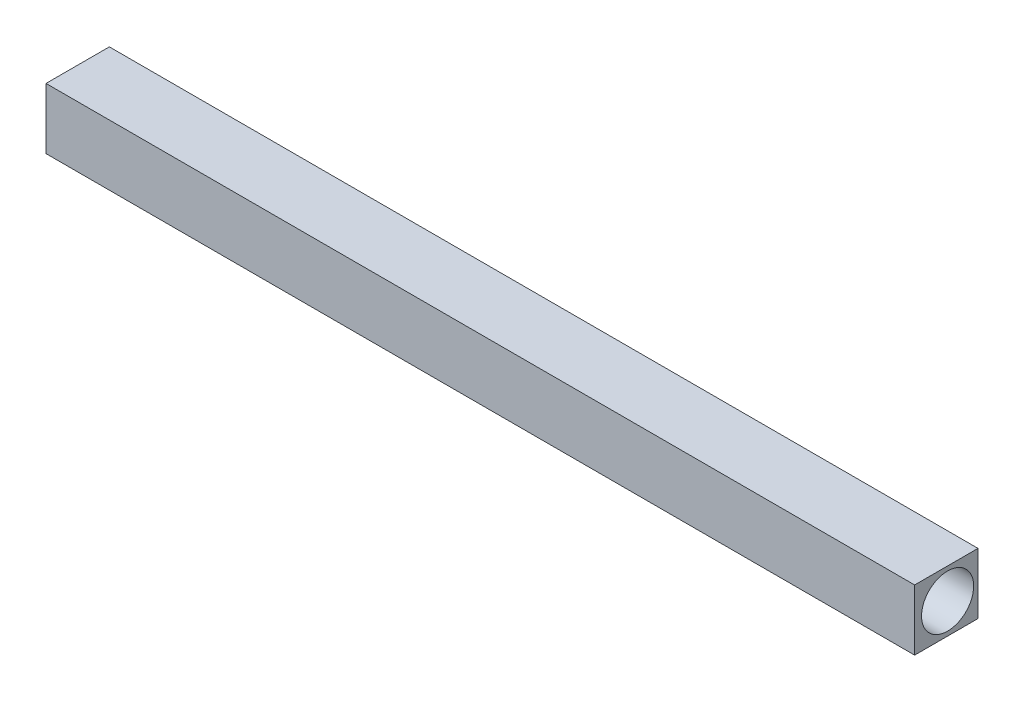
ISO-10303-21;
HEADER;
FILE_DESCRIPTION(('STEP AP214'),'2;1');
FILE_NAME('part.step','',(''),(''),'','','');
FILE_SCHEMA(('AUTOMOTIVE_DESIGN { 1 0 10303 214 1 1 1 1 }'));
ENDSEC;
DATA;
#1=APPLICATION_CONTEXT('core data for automotive mechanical design processes');
#2=APPLICATION_PROTOCOL_DEFINITION('international standard','automotive_design',2000,#1);
#3=PRODUCT_CONTEXT('',#1,'mechanical');
#4=PRODUCT('Part','Part','',(#3));
#5=PRODUCT_RELATED_PRODUCT_CATEGORY('part','',(#4));
#6=PRODUCT_DEFINITION_FORMATION('','',#4);
#7=PRODUCT_DEFINITION_CONTEXT('part definition',#1,'design');
#8=PRODUCT_DEFINITION('design','',#6,#7);
#9=PRODUCT_DEFINITION_SHAPE('','',#8);
#10=(LENGTH_UNIT() NAMED_UNIT(*) SI_UNIT(.MILLI.,.METRE.));
#11=(NAMED_UNIT(*) PLANE_ANGLE_UNIT() SI_UNIT($,.RADIAN.));
#12=(NAMED_UNIT(*) SI_UNIT($,.STERADIAN.) SOLID_ANGLE_UNIT());
#13=UNCERTAINTY_MEASURE_WITH_UNIT(LENGTH_MEASURE(1.E-05),#10,'distance_accuracy_value','');
#14=(GEOMETRIC_REPRESENTATION_CONTEXT(3) GLOBAL_UNCERTAINTY_ASSIGNED_CONTEXT((#13)) GLOBAL_UNIT_ASSIGNED_CONTEXT((#10,
#11,#12)) REPRESENTATION_CONTEXT('',''));
#15=CARTESIAN_POINT('',(0.,0.,0.));
#16=DIRECTION('',(0.,0.,1.));
#17=DIRECTION('',(1.,0.,0.));
#18=AXIS2_PLACEMENT_3D('',#15,#16,#17);
#19=CARTESIAN_POINT('',(-59.3425127184251,35.,0.));
#20=DIRECTION('',(1.,0.,0.));
#21=DIRECTION('',(0.,0.,-1.));
#22=AXIS2_PLACEMENT_3D('',#19,#20,#21);
#23=PLANE('',#22);
#24=CARTESIAN_POINT('',(-59.3425127184251,17.5,17.5));
#25=DIRECTION('',(1.,0.,0.));
#26=DIRECTION('',(0.,0.,-1.));
#27=AXIS2_PLACEMENT_3D('',#24,#25,#26);
#28=CIRCLE('',#27,15.);
#29=CARTESIAN_POINT('',(-59.3425127184251,17.5,2.5));
#30=VERTEX_POINT('',#29);
#31=EDGE_CURVE('E99',#30,#30,#28,.T.);
#32=ORIENTED_EDGE('',*,*,#31,.T.);
#33=EDGE_LOOP('',(#32));
#34=FACE_BOUND('',#33,.T.);
#35=DIRECTION('',(0.,0.,1.));
#36=VECTOR('',#35,1.);
#37=CARTESIAN_POINT('',(-59.3425127184251,0.,0.));
#38=LINE('',#37,#36);
#39=CARTESIAN_POINT('',(-59.3425127184251,0.,0.));
#40=VERTEX_POINT('',#39);
#41=CARTESIAN_POINT('',(-59.3425127184251,0.,36.4583333333333));
#42=VERTEX_POINT('',#41);
#43=EDGE_CURVE('E96',#40,#42,#38,.T.);
#44=ORIENTED_EDGE('',*,*,#43,.T.);
#45=DIRECTION('',(0.,-1.,0.));
#46=VECTOR('',#45,1.);
#47=CARTESIAN_POINT('',(-59.3425127184251,35.,36.4583333333333));
#48=LINE('',#47,#46);
#49=CARTESIAN_POINT('',(-59.3425127184251,35.,36.4583333333333));
#50=VERTEX_POINT('',#49);
#51=EDGE_CURVE('E11',#50,#42,#48,.T.);
#52=ORIENTED_EDGE('',*,*,#51,.F.);
#53=DIRECTION('',(0.,0.,1.));
#54=VECTOR('',#53,1.);
#55=CARTESIAN_POINT('',(-59.3425127184251,35.,0.));
#56=LINE('',#55,#54);
#57=CARTESIAN_POINT('',(-59.3425127184251,35.,0.));
#58=VERTEX_POINT('',#57);
#59=EDGE_CURVE('E84',#58,#50,#56,.T.);
#60=ORIENTED_EDGE('',*,*,#59,.F.);
#61=DIRECTION('',(0.,-1.,0.));
#62=VECTOR('',#61,1.);
#63=CARTESIAN_POINT('',(-59.3425127184251,35.,0.));
#64=LINE('',#63,#62);
#65=EDGE_CURVE('E92',#58,#40,#64,.T.);
#66=ORIENTED_EDGE('',*,*,#65,.T.);
#67=EDGE_LOOP('',(#44,#52,#60,#66));
#68=FACE_BOUND('',#67,.T.);
#69=ADVANCED_FACE('F33',(#34,#68),#23,.F.);
#70=CARTESIAN_POINT('',(-59.3425127184251,35.,36.4583333333333));
#71=DIRECTION('',(0.,0.,-1.));
#72=DIRECTION('',(-1.,0.,0.));
#73=AXIS2_PLACEMENT_3D('',#70,#71,#72);
#74=PLANE('',#73);
#75=DIRECTION('',(1.,0.,0.));
#76=VECTOR('',#75,1.);
#77=CARTESIAN_POINT('',(-59.3425127184251,0.,36.4583333333333));
#78=LINE('',#77,#76);
#79=CARTESIAN_POINT('',(440.657487281575,0.,36.4583333333333));
#80=VERTEX_POINT('',#79);
#81=EDGE_CURVE('E88',#42,#80,#78,.T.);
#82=ORIENTED_EDGE('',*,*,#81,.T.);
#83=DIRECTION('',(0.,-1.,0.));
#84=VECTOR('',#83,1.);
#85=CARTESIAN_POINT('',(440.657487281575,35.,36.4583333333333));
#86=LINE('',#85,#84);
#87=CARTESIAN_POINT('',(440.657487281575,35.,36.4583333333333));
#88=VERTEX_POINT('',#87);
#89=EDGE_CURVE('E41',#88,#80,#86,.T.);
#90=ORIENTED_EDGE('',*,*,#89,.F.);
#91=DIRECTION('',(1.,0.,0.));
#92=VECTOR('',#91,1.);
#93=CARTESIAN_POINT('',(-59.3425127184251,35.,36.4583333333333));
#94=LINE('',#93,#92);
#95=EDGE_CURVE('E79',#50,#88,#94,.T.);
#96=ORIENTED_EDGE('',*,*,#95,.F.);
#97=ORIENTED_EDGE('',*,*,#51,.T.);
#98=EDGE_LOOP('',(#82,#90,#96,#97));
#99=FACE_BOUND('',#98,.T.);
#100=ADVANCED_FACE('F87',(#99),#74,.F.);
#101=CARTESIAN_POINT('',(440.657487281575,35.,0.));
#102=DIRECTION('',(-1.,0.,0.));
#103=DIRECTION('',(0.,0.,1.));
#104=AXIS2_PLACEMENT_3D('',#101,#102,#103);
#105=PLANE('',#104);
#106=CARTESIAN_POINT('',(440.657487281575,17.5,17.5));
#107=DIRECTION('',(1.,0.,0.));
#108=DIRECTION('',(0.,0.,-1.));
#109=AXIS2_PLACEMENT_3D('',#106,#107,#108);
#110=CIRCLE('',#109,15.);
#111=CARTESIAN_POINT('',(440.657487281575,17.5,2.5));
#112=VERTEX_POINT('',#111);
#113=EDGE_CURVE('E110',#112,#112,#110,.T.);
#114=ORIENTED_EDGE('',*,*,#113,.F.);
#115=EDGE_LOOP('',(#114));
#116=FACE_BOUND('',#115,.T.);
#117=DIRECTION('',(0.,0.,-1.));
#118=VECTOR('',#117,1.);
#119=CARTESIAN_POINT('',(440.657487281575,0.,0.));
#120=LINE('',#119,#118);
#121=CARTESIAN_POINT('',(440.657487281575,0.,0.));
#122=VERTEX_POINT('',#121);
#123=EDGE_CURVE('E66',#80,#122,#120,.T.);
#124=ORIENTED_EDGE('',*,*,#123,.T.);
#125=DIRECTION('',(0.,-1.,0.));
#126=VECTOR('',#125,1.);
#127=CARTESIAN_POINT('',(440.657487281575,35.,0.));
#128=LINE('',#127,#126);
#129=CARTESIAN_POINT('',(440.657487281575,35.,0.));
#130=VERTEX_POINT('',#129);
#131=EDGE_CURVE('E89',#130,#122,#128,.T.);
#132=ORIENTED_EDGE('',*,*,#131,.F.);
#133=DIRECTION('',(0.,0.,-1.));
#134=VECTOR('',#133,1.);
#135=CARTESIAN_POINT('',(440.657487281575,35.,0.));
#136=LINE('',#135,#134);
#137=EDGE_CURVE('E82',#88,#130,#136,.T.);
#138=ORIENTED_EDGE('',*,*,#137,.F.);
#139=ORIENTED_EDGE('',*,*,#89,.T.);
#140=EDGE_LOOP('',(#124,#132,#138,#139));
#141=FACE_BOUND('',#140,.T.);
#142=ADVANCED_FACE('F90',(#116,#141),#105,.F.);
#143=CARTESIAN_POINT('',(-59.3425127184251,35.,0.));
#144=DIRECTION('',(0.,0.,1.));
#145=DIRECTION('',(1.,0.,0.));
#146=AXIS2_PLACEMENT_3D('',#143,#144,#145);
#147=PLANE('',#146);
#148=DIRECTION('',(-1.,0.,0.));
#149=VECTOR('',#148,1.);
#150=CARTESIAN_POINT('',(-59.3425127184251,0.,0.));
#151=LINE('',#150,#149);
#152=EDGE_CURVE('E72',#122,#40,#151,.T.);
#153=ORIENTED_EDGE('',*,*,#152,.T.);
#154=ORIENTED_EDGE('',*,*,#65,.F.);
#155=DIRECTION('',(-1.,0.,0.));
#156=VECTOR('',#155,1.);
#157=CARTESIAN_POINT('',(-59.3425127184251,35.,0.));
#158=LINE('',#157,#156);
#159=EDGE_CURVE('E49',#130,#58,#158,.T.);
#160=ORIENTED_EDGE('',*,*,#159,.F.);
#161=ORIENTED_EDGE('',*,*,#131,.T.);
#162=EDGE_LOOP('',(#153,#154,#160,#161));
#163=FACE_BOUND('',#162,.T.);
#164=ADVANCED_FACE('F104',(#163),#147,.F.);
#165=CARTESIAN_POINT('',(0.,35.,0.));
#166=DIRECTION('',(0.,1.,0.));
#167=DIRECTION('',(0.,0.,1.));
#168=AXIS2_PLACEMENT_3D('',#165,#166,#167);
#169=PLANE('',#168);
#170=ORIENTED_EDGE('',*,*,#59,.T.);
#171=ORIENTED_EDGE('',*,*,#95,.T.);
#172=ORIENTED_EDGE('',*,*,#137,.T.);
#173=ORIENTED_EDGE('',*,*,#159,.T.);
#174=EDGE_LOOP('',(#170,#171,#172,#173));
#175=FACE_BOUND('',#174,.T.);
#176=ADVANCED_FACE('F80',(#175),#169,.T.);
#177=CARTESIAN_POINT('',(0.,0.,0.));
#178=DIRECTION('',(0.,1.,0.));
#179=DIRECTION('',(0.,0.,1.));
#180=AXIS2_PLACEMENT_3D('',#177,#178,#179);
#181=PLANE('',#180);
#182=ORIENTED_EDGE('',*,*,#43,.F.);
#183=ORIENTED_EDGE('',*,*,#152,.F.);
#184=ORIENTED_EDGE('',*,*,#123,.F.);
#185=ORIENTED_EDGE('',*,*,#81,.F.);
#186=EDGE_LOOP('',(#182,#183,#184,#185));
#187=FACE_BOUND('',#186,.T.);
#188=ADVANCED_FACE('F107',(#187),#181,.F.);
#189=CARTESIAN_POINT('',(-59.3425127184251,17.5,17.5));
#190=DIRECTION('',(1.,0.,0.));
#191=DIRECTION('',(0.,0.,-1.));
#192=AXIS2_PLACEMENT_3D('',#189,#190,#191);
#193=CYLINDRICAL_SURFACE('',#192,15.);
#194=ORIENTED_EDGE('',*,*,#31,.F.);
#195=EDGE_LOOP('',(#194));
#196=FACE_BOUND('',#195,.T.);
#197=ORIENTED_EDGE('',*,*,#113,.T.);
#198=EDGE_LOOP('',(#197));
#199=FACE_BOUND('',#198,.T.);
#200=ADVANCED_FACE('F117',(#196,#199),#193,.F.);
#201=CLOSED_SHELL('',(#69,#100,#142,#164,#176,#188,#200));
#202=MANIFOLD_SOLID_BREP('B2',#201);
#203=ADVANCED_BREP_SHAPE_REPRESENTATION('',(#18,#202),#14);
#204=SHAPE_DEFINITION_REPRESENTATION(#9,#203);
ENDSEC;
END-ISO-10303-21;
